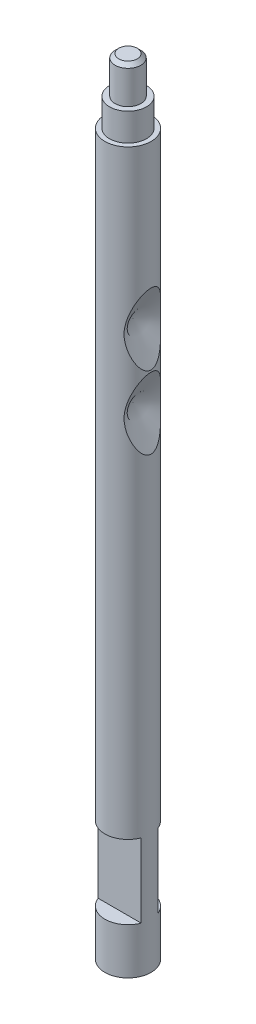
ISO-10303-21;
HEADER;
FILE_DESCRIPTION(('STEP AP214'),'2;1');
FILE_NAME('part.step','',(''),(''),'','','');
FILE_SCHEMA(('AUTOMOTIVE_DESIGN { 1 0 10303 214 1 1 1 1 }'));
ENDSEC;
DATA;
#1=APPLICATION_CONTEXT('core data for automotive mechanical design processes');
#2=APPLICATION_PROTOCOL_DEFINITION('international standard','automotive_design',2000,#1);
#3=PRODUCT_CONTEXT('',#1,'mechanical');
#4=PRODUCT('Part','Part','',(#3));
#5=PRODUCT_RELATED_PRODUCT_CATEGORY('part','',(#4));
#6=PRODUCT_DEFINITION_FORMATION('','',#4);
#7=PRODUCT_DEFINITION_CONTEXT('part definition',#1,'design');
#8=PRODUCT_DEFINITION('design','',#6,#7);
#9=PRODUCT_DEFINITION_SHAPE('','',#8);
#10=(LENGTH_UNIT() NAMED_UNIT(*) SI_UNIT(.MILLI.,.METRE.));
#11=(NAMED_UNIT(*) PLANE_ANGLE_UNIT() SI_UNIT($,.RADIAN.));
#12=(NAMED_UNIT(*) SI_UNIT($,.STERADIAN.) SOLID_ANGLE_UNIT());
#13=UNCERTAINTY_MEASURE_WITH_UNIT(LENGTH_MEASURE(1.E-05),#10,'distance_accuracy_value','');
#14=(GEOMETRIC_REPRESENTATION_CONTEXT(3) GLOBAL_UNCERTAINTY_ASSIGNED_CONTEXT((#13)) GLOBAL_UNIT_ASSIGNED_CONTEXT((#10,
#11,#12)) REPRESENTATION_CONTEXT('',''));
#15=CARTESIAN_POINT('',(0.,0.,0.));
#16=DIRECTION('',(0.,0.,1.));
#17=DIRECTION('',(1.,0.,0.));
#18=AXIS2_PLACEMENT_3D('',#15,#16,#17);
#19=CARTESIAN_POINT('',(0.,42.5,0.));
#20=DIRECTION('',(0.,-1.,0.));
#21=DIRECTION('',(0.,0.,-1.));
#22=AXIS2_PLACEMENT_3D('',#19,#20,#21);
#23=CYLINDRICAL_SURFACE('',#22,1.25);
#24=CARTESIAN_POINT('',(1.17700754416202,28.4703723541702,-0.420895760237988));
#25=CARTESIAN_POINT('',(1.16705893344819,28.4972373369061,-0.448715757895762));
#26=CARTESIAN_POINT('',(1.15661367019414,28.5256537161564,-0.474836641157097));
#27=CARTESIAN_POINT('',(1.13511480437951,28.5847272748539,-0.524153147493915));
#28=CARTESIAN_POINT('',(1.12406049890396,28.6153870574579,-0.547345284343482));
#29=CARTESIAN_POINT('',(1.09033386618107,28.7100502531933,-0.613296351795831));
#30=CARTESIAN_POINT('',(1.06717284473713,28.7765373884661,-0.652238412815612));
#31=CARTESIAN_POINT('',(1.0231512667563,28.9073281205972,-0.719097522926084));
#32=CARTESIAN_POINT('',(1.00227018597646,28.971295399089,-0.74768902668909));
#33=CARTESIAN_POINT('',(0.961505792249867,29.101769392957,-0.799432140869496));
#34=CARTESIAN_POINT('',(0.941623404522958,29.1682783661546,-0.822578777522072));
#35=CARTESIAN_POINT('',(0.903755748952343,29.3032465040863,-0.864008244839188));
#36=CARTESIAN_POINT('',(0.885768994276675,29.3717040860924,-0.882294904799336));
#37=CARTESIAN_POINT('',(0.852656109638179,29.5103295133008,-0.914334763419557));
#38=CARTESIAN_POINT('',(0.837528704912905,29.5804965805505,-0.928089984338496));
#39=CARTESIAN_POINT('',(0.812951954647161,29.7131031179047,-0.949652987862396));
#40=CARTESIAN_POINT('',(0.803020660048595,29.7753646239504,-0.958000733635408));
#41=CARTESIAN_POINT('',(0.786916058357426,29.9007289571736,-0.971274061679395));
#42=CARTESIAN_POINT('',(0.780741630865186,29.9638315277804,-0.97620066429001));
#43=CARTESIAN_POINT('',(0.772732929573768,30.0902980687057,-0.982553221289259));
#44=CARTESIAN_POINT('',(0.770885232227128,30.153660617957,-0.983990003257437));
#45=CARTESIAN_POINT('',(0.771681984158448,30.2803395707878,-0.983365171318705));
#46=CARTESIAN_POINT('',(0.77432645228205,30.3436559741727,-0.981303542735177));
#47=CARTESIAN_POINT('',(0.783818375409114,30.4695091406526,-0.973737302136117));
#48=CARTESIAN_POINT('',(0.790649597463785,30.5320479677022,-0.968245986199218));
#49=CARTESIAN_POINT('',(0.807895464307165,30.6562419585596,-0.953902209874888));
#50=CARTESIAN_POINT('',(0.818311047784375,30.7178968864777,-0.945048868962498));
#51=CARTESIAN_POINT('',(0.84204319275684,30.8403696289293,-0.923967932773515));
#52=CARTESIAN_POINT('',(0.855373353798028,30.9011820481806,-0.911724445074953));
#53=CARTESIAN_POINT('',(0.884171817353476,31.0214679985091,-0.883820765043956));
#54=CARTESIAN_POINT('',(0.899639781347253,31.0809417398352,-0.868161113433456));
#55=CARTESIAN_POINT('',(0.944795922310425,31.2445231716915,-0.819566705107155));
#56=CARTESIAN_POINT('',(0.976129928010713,31.3470905647322,-0.782710185981296));
#57=CARTESIAN_POINT('',(1.0242110071141,31.4956633802668,-0.717088162501467));
#58=CARTESIAN_POINT('',(1.04038096606971,31.5442060004323,-0.693554886867818));
#59=CARTESIAN_POINT('',(1.0727002288581,31.6391041636392,-0.642442069064977));
#60=CARTESIAN_POINT('',(1.08884953749296,31.6854617861837,-0.614866481174767));
#61=CARTESIAN_POINT('',(1.11703608581593,31.7650303127607,-0.561623174348711));
#62=CARTESIAN_POINT('',(1.12917973232564,31.7988493166575,-0.536926355109136));
#63=CARTESIAN_POINT('',(1.15283661032137,31.8640440146621,-0.484054259965215));
#64=CARTESIAN_POINT('',(1.16434873730079,31.8954154661437,-0.455873153652531));
#65=CARTESIAN_POINT('',(1.18635313874643,31.954889008242,-0.395126790579454));
#66=CARTESIAN_POINT('',(1.19683191019419,31.982948568894,-0.362514111853164));
#67=CARTESIAN_POINT('',(1.2157928214634,32.0334163864176,-0.29265151005307));
#68=CARTESIAN_POINT('',(1.22428223524554,32.05584525373,-0.255419267219288));
#69=CARTESIAN_POINT('',(1.23547132517324,32.085301596777,-0.191625508346729));
#70=CARTESIAN_POINT('',(1.23914283154282,32.0949368996846,-0.166447027404074));
#71=CARTESIAN_POINT('',(1.24499264317535,32.1102681127089,-0.114748544225874));
#72=CARTESIAN_POINT('',(1.24717268586347,32.1159686066045,-0.0882301417036052));
#73=CARTESIAN_POINT('',(1.24982005396749,32.1228891465963,-0.0343556187429182));
#74=CARTESIAN_POINT('',(1.25027725489259,32.1240827072312,-0.00699549593762304));
#75=CARTESIAN_POINT('',(1.24939460335811,32.1217765805468,0.04749983381859));
#76=CARTESIAN_POINT('',(1.24805422600373,32.1182755223937,0.0746349727456661));
#77=CARTESIAN_POINT('',(1.24388227344739,32.107358292531,0.126002808733217));
#78=CARTESIAN_POINT('',(1.24115917800984,32.1002268476282,0.150306977103077));
#79=CARTESIAN_POINT('',(1.23451986126001,32.0827965824656,0.197562675615671));
#80=CARTESIAN_POINT('',(1.23060312668679,32.0724963996407,0.220513618799267));
#81=CARTESIAN_POINT('',(1.21899833343928,32.0418807314936,0.279151981332276));
#82=CARTESIAN_POINT('',(1.21050489554076,32.0193845486027,0.313537098217497));
#83=CARTESIAN_POINT('',(1.19188147555419,31.969696365925,0.378228574862608));
#84=CARTESIAN_POINT('',(1.18174641555693,31.942489777191,0.408521726163367));
#85=CARTESIAN_POINT('',(1.15205583563401,31.8620622729859,0.48811962112393));
#86=CARTESIAN_POINT('',(1.13140787547333,31.8053325818934,0.533430839428546));
#87=CARTESIAN_POINT('',(1.08905605918043,31.6862525357468,0.615281410363181));
#88=CARTESIAN_POINT('',(1.06734894426846,31.6238842549699,0.651791330492064));
#89=CARTESIAN_POINT('',(1.02477862081227,31.4975982840995,0.71678614253526));
#90=CARTESIAN_POINT('',(1.00391057463346,31.4337934213398,0.745489812587917));
#91=CARTESIAN_POINT('',(0.963154713447086,31.3036575582663,0.797447045799542));
#92=CARTESIAN_POINT('',(0.943267827512796,31.2373242652244,0.820695518722373));
#93=CARTESIAN_POINT('',(0.905336381265718,31.1026245920698,0.862356018862954));
#94=CARTESIAN_POINT('',(0.887292379755656,31.0342576033626,0.880766581766968));
#95=CARTESIAN_POINT('',(0.85403182419341,30.8958103106608,0.91305337112989));
#96=CARTESIAN_POINT('',(0.838814004961461,30.8257307892818,0.926931628658968));
#97=CARTESIAN_POINT('',(0.814016024782304,30.6931973845285,0.948743710051295));
#98=CARTESIAN_POINT('',(0.803962680521001,30.6309209255944,0.957212266342356));
#99=CARTESIAN_POINT('',(0.787596646356649,30.5055145675941,0.970724172707706));
#100=CARTESIAN_POINT('',(0.781282844837876,30.4423849278574,0.975768540720722));
#101=CARTESIAN_POINT('',(0.77299036301433,30.3158694895934,0.982351677461078));
#102=CARTESIAN_POINT('',(0.770996851219752,30.2524853182397,0.983902440409341));
#103=CARTESIAN_POINT('',(0.771507249631646,30.125746766541,0.983502220268506));
#104=CARTESIAN_POINT('',(0.774011146950446,30.0623923861112,0.981551247213903));
#105=CARTESIAN_POINT('',(0.783242327580703,29.936434017691,0.97419966353613));
#106=CARTESIAN_POINT('',(0.789954391392081,29.8738281505507,0.968811482895699));
#107=CARTESIAN_POINT('',(0.806989191409499,29.7494905697253,0.954667447572539));
#108=CARTESIAN_POINT('',(0.817312877795704,29.6877590905338,0.945910706596336));
#109=CARTESIAN_POINT('',(0.84088850804749,29.5651254659972,0.925016380385098));
#110=CARTESIAN_POINT('',(0.854154590106005,29.5042288856502,0.912862395434873));
#111=CARTESIAN_POINT('',(0.882851962952468,29.383751536696,0.885138783001195));
#112=CARTESIAN_POINT('',(0.898282917306856,29.3241705652977,0.869569686034266));
#113=CARTESIAN_POINT('',(0.929027361646688,29.212437211295,0.836578853724176));
#114=CARTESIAN_POINT('',(0.944195294165326,29.1601423423813,0.819503072213711));
#115=CARTESIAN_POINT('',(0.975338537271264,29.0569469449319,0.782180377493527));
#116=CARTESIAN_POINT('',(0.991313691678023,29.0060461495886,0.761934076133883));
#117=CARTESIAN_POINT('',(1.02359684509875,28.9061822839057,0.717976575882371));
#118=CARTESIAN_POINT('',(1.0399028453099,28.8572109871001,0.694282723486387));
#119=CARTESIAN_POINT('',(1.07249302102962,28.7614914222474,0.642797565575012));
#120=CARTESIAN_POINT('',(1.08877720209323,28.714740987341,0.615010367168398));
#121=CARTESIAN_POINT('',(1.1170134303573,28.6350347301172,0.56166042407272));
#122=CARTESIAN_POINT('',(1.12907833549276,28.601433513415,0.537128648602745));
#123=CARTESIAN_POINT('',(1.15258684595553,28.5366409484157,0.484636492813877));
#124=CARTESIAN_POINT('',(1.16402940664587,28.5054536169568,0.456670589741793));
#125=CARTESIAN_POINT('',(1.18591174142874,28.4462981555217,0.396427762514851));
#126=CARTESIAN_POINT('',(1.19633867016194,28.418370548987,0.36410554098452));
#127=CARTESIAN_POINT('',(1.2152419560557,28.36804392706,0.294892913040601));
#128=CARTESIAN_POINT('',(1.22372508194501,28.3456257064204,0.258019068664501));
#129=CARTESIAN_POINT('',(1.23500528205099,28.3159229164981,0.19460704141875));
#130=CARTESIAN_POINT('',(1.23873986457195,28.3061203242518,0.169423791068805));
#131=CARTESIAN_POINT('',(1.24471862923363,28.2904490080629,0.11768928038964));
#132=CARTESIAN_POINT('',(1.24696457340489,28.2845756332152,0.0911396776236754));
#133=CARTESIAN_POINT('',(1.24974092646769,28.2773174981626,0.0371633189000191));
#134=CARTESIAN_POINT('',(1.25026082530171,28.2759602369002,0.00973221238245091));
#135=CARTESIAN_POINT('',(1.24949132955607,28.2779706873298,-0.0449339812043712));
#136=CARTESIAN_POINT('',(1.24820144108602,28.2813396888174,-0.0721690127258681));
#137=CARTESIAN_POINT('',(1.24411739889914,28.292026068605,-0.123662918690289));
#138=CARTESIAN_POINT('',(1.24143745904244,28.2990437451508,-0.147995320867128));
#139=CARTESIAN_POINT('',(1.23487734470092,28.3162638556021,-0.195319394268734));
#140=CARTESIAN_POINT('',(1.23099664266844,28.3264676893449,-0.218310470902912));
#141=CARTESIAN_POINT('',(1.22006922097998,28.3552909453137,-0.274040022848182));
#142=CARTESIAN_POINT('',(1.2124152145353,28.3755532976832,-0.305804368562986));
#143=CARTESIAN_POINT('',(1.1956649631858,28.4201843795094,-0.365872545797073));
#144=CARTESIAN_POINT('',(1.18656545866663,28.4445623978313,-0.394168293782631));
#145=CARTESIAN_POINT('',(1.17700754416202,28.4703723541702,-0.420895760237988));
#146=B_SPLINE_CURVE_WITH_KNOTS('',3,(#24,#25,#26,#27,#28,#29,#30,#31,#32,#33,#34,#35,#36,#37,
#38,#39,#40,#41,#42,#43,#44,#45,#46,#47,#48,#49,#50,#51,#52,#53,#54,#55,#56,#57,#58,#59,#60,#61,
#62,#63,#64,#65,#66,#67,#68,#69,#70,#71,#72,#73,#74,#75,#76,#77,#78,#79,#80,#81,#82,#83,#84,#85,
#86,#87,#88,#89,#90,#91,#92,#93,#94,#95,#96,#97,#98,#99,#100,#101,#102,#103,#104,#105,#106,#107,
#108,#109,#110,#111,#112,#113,#114,#115,#116,#117,#118,#119,#120,#121,#122,#123,#124,#125,#126,
#127,#128,#129,#130,#131,#132,#133,#134,#135,#136,#137,#138,#139,#140,#141,#142,#143,#144,#145),
.UNSPECIFIED.,.T.,.F.,(4,2,2,2,2,2,2,2,2,2,2,2,2,2,2,2,2,2,2,2,2,2,2,2,2,2,2,2,2,2,2,2,2,2,2,2,
2,2,2,2,2,2,2,2,2,2,2,2,2,2,2,2,2,2,2,2,2,2,2,2,4),(0.,0.119733935575624,0.239609078953534,
0.480210272847163,0.699298309294528,0.918585707288308,1.13769980760633,1.35671599033374,
1.54732835293315,1.73788384185972,1.92784735043226,2.11781165594633,2.30704404781057,
2.49632603445497,2.68651081952802,2.87666552332612,3.21581316174002,3.3846391698961,
3.55330111737477,3.68394744398935,3.81481542313575,3.94721403474959,4.07912071002707,
4.16044538585602,4.2416751634759,4.32338156002472,4.40511182012531,4.48124144317045,
4.55740384800416,4.68255144133255,4.80809380860544,5.03327726160536,5.25920361904884,
5.4779255990607,5.69685086377203,5.91584231553195,6.13473549516169,6.32549777462209,
6.51620331962841,6.70625313137821,6.89630239852649,7.08566825632411,7.27508397181342,
7.46543034384503,7.65574716765958,7.82684134494292,7.99790254489879,8.16813103810837,
8.33818987938421,8.46798541511413,8.59799249065811,8.72947408294129,8.86049062470549,
8.94203426781786,9.0234812184025,9.10542320655454,9.18738756099924,9.26348832570083,
9.33962257240445,9.4543918055884,9.56942361781327),.UNSPECIFIED.);
#147=CARTESIAN_POINT('',(1.17700754416202,28.4703723541702,-0.420895760237988));
#148=VERTEX_POINT('',#147);
#149=EDGE_CURVE('E51',#148,#148,#146,.T.);
#150=ORIENTED_EDGE('',*,*,#149,.F.);
#151=EDGE_LOOP('',(#150));
#152=FACE_BOUND('',#151,.T.);
#153=CARTESIAN_POINT('',(0.,6.5,0.));
#154=DIRECTION('',(0.,1.,0.));
#155=DIRECTION('',(0.,0.,1.));
#156=AXIS2_PLACEMENT_3D('',#153,#154,#155);
#157=CIRCLE('',#156,1.25);
#158=CARTESIAN_POINT('',(-1.16619037896906,6.5,0.449999999999996));
#159=VERTEX_POINT('',#158);
#160=CARTESIAN_POINT('',(1.16619037896906,6.5,0.450000000000001));
#161=VERTEX_POINT('',#160);
#162=EDGE_CURVE('E191',#159,#161,#157,.T.);
#163=ORIENTED_EDGE('',*,*,#162,.T.);
#164=DIRECTION('',(0.,-1.,0.));
#165=VECTOR('',#164,1.);
#166=CARTESIAN_POINT('',(1.16619037896906,42.5,0.449999999999996));
#167=LINE('',#166,#165);
#168=CARTESIAN_POINT('',(1.16619037896906,2.5,0.450000000000001));
#169=VERTEX_POINT('',#168);
#170=EDGE_CURVE('E116',#161,#169,#167,.T.);
#171=ORIENTED_EDGE('',*,*,#170,.T.);
#172=CARTESIAN_POINT('',(0.,2.5,0.));
#173=DIRECTION('',(0.,-1.,0.));
#174=DIRECTION('',(0.,0.,-1.));
#175=AXIS2_PLACEMENT_3D('',#172,#173,#174);
#176=CIRCLE('',#175,1.25);
#177=CARTESIAN_POINT('',(-1.16619037896906,2.5,0.450000000000001));
#178=VERTEX_POINT('',#177);
#179=EDGE_CURVE('E192',#169,#178,#176,.T.);
#180=ORIENTED_EDGE('',*,*,#179,.T.);
#181=DIRECTION('',(0.,-1.,0.));
#182=VECTOR('',#181,1.);
#183=CARTESIAN_POINT('',(-1.16619037896906,42.5,0.449999999999996));
#184=LINE('',#183,#182);
#185=EDGE_CURVE('E188',#178,#159,#184,.F.);
#186=ORIENTED_EDGE('',*,*,#185,.T.);
#187=EDGE_LOOP('',(#163,#171,#180,#186));
#188=FACE_BOUND('',#187,.T.);
#189=DIRECTION('',(0.,-1.,0.));
#190=VECTOR('',#189,1.);
#191=CARTESIAN_POINT('',(1.16619037896906,42.5,-0.449999999999996));
#192=LINE('',#191,#190);
#193=CARTESIAN_POINT('',(1.16619037896906,2.5,-0.450000000000001));
#194=VERTEX_POINT('',#193);
#195=CARTESIAN_POINT('',(1.16619037896906,6.5,-0.450000000000001));
#196=VERTEX_POINT('',#195);
#197=EDGE_CURVE('E181',#194,#196,#192,.F.);
#198=ORIENTED_EDGE('',*,*,#197,.T.);
#199=CARTESIAN_POINT('',(0.,6.5,0.));
#200=DIRECTION('',(0.,1.,0.));
#201=DIRECTION('',(0.,0.,1.));
#202=AXIS2_PLACEMENT_3D('',#199,#200,#201);
#203=CIRCLE('',#202,1.25);
#204=CARTESIAN_POINT('',(-1.16619037896906,6.5,-0.450000000000001));
#205=VERTEX_POINT('',#204);
#206=EDGE_CURVE('E65',#196,#205,#203,.T.);
#207=ORIENTED_EDGE('',*,*,#206,.T.);
#208=DIRECTION('',(0.,-1.,0.));
#209=VECTOR('',#208,1.);
#210=CARTESIAN_POINT('',(-1.16619037896906,42.5,-0.449999999999996));
#211=LINE('',#210,#209);
#212=CARTESIAN_POINT('',(-1.16619037896906,2.5,-0.450000000000001));
#213=VERTEX_POINT('',#212);
#214=EDGE_CURVE('E184',#205,#213,#211,.T.);
#215=ORIENTED_EDGE('',*,*,#214,.T.);
#216=CARTESIAN_POINT('',(0.,2.5,0.));
#217=DIRECTION('',(0.,-1.,0.));
#218=DIRECTION('',(0.,0.,-1.));
#219=AXIS2_PLACEMENT_3D('',#216,#217,#218);
#220=CIRCLE('',#219,1.25);
#221=EDGE_CURVE('E171',#213,#194,#220,.T.);
#222=ORIENTED_EDGE('',*,*,#221,.T.);
#223=EDGE_LOOP('',(#198,#207,#215,#222));
#224=FACE_BOUND('',#223,.T.);
#225=CARTESIAN_POINT('',(0.,0.,0.));
#226=DIRECTION('',(0.,1.,0.));
#227=DIRECTION('',(0.,0.,1.));
#228=AXIS2_PLACEMENT_3D('',#225,#226,#227);
#229=CIRCLE('',#228,1.25);
#230=CARTESIAN_POINT('',(0.,0.,1.25));
#231=VERTEX_POINT('',#230);
#232=EDGE_CURVE('E168',#231,#231,#229,.T.);
#233=ORIENTED_EDGE('',*,*,#232,.T.);
#234=EDGE_LOOP('',(#233));
#235=FACE_BOUND('',#234,.T.);
#236=CARTESIAN_POINT('',(0.,39.,0.));
#237=DIRECTION('',(0.,1.,0.));
#238=DIRECTION('',(0.,0.,1.));
#239=AXIS2_PLACEMENT_3D('',#236,#237,#238);
#240=CIRCLE('',#239,1.25);
#241=CARTESIAN_POINT('',(0.,39.,1.25));
#242=VERTEX_POINT('',#241);
#243=EDGE_CURVE('E174',#242,#242,#240,.T.);
#244=ORIENTED_EDGE('',*,*,#243,.F.);
#245=EDGE_LOOP('',(#244));
#246=FACE_BOUND('',#245,.T.);
#247=CARTESIAN_POINT('',(1.17700754416202,24.5203723541702,-0.420895760237988));
#248=CARTESIAN_POINT('',(1.16705893344819,24.5472373369061,-0.448715757895762));
#249=CARTESIAN_POINT('',(1.15661367019414,24.5756537161564,-0.474836641157097));
#250=CARTESIAN_POINT('',(1.13511480437951,24.6347272748539,-0.524153147493916));
#251=CARTESIAN_POINT('',(1.12406049890396,24.6653870574579,-0.547345284343483));
#252=CARTESIAN_POINT('',(1.09033386618107,24.7600502531933,-0.613296351795832));
#253=CARTESIAN_POINT('',(1.06717284473713,24.8265373884661,-0.652238412815612));
#254=CARTESIAN_POINT('',(1.0231512667563,24.9573281205972,-0.719097522926084));
#255=CARTESIAN_POINT('',(1.00227018597646,25.021295399089,-0.74768902668909));
#256=CARTESIAN_POINT('',(0.961505792249867,25.151769392957,-0.799432140869496));
#257=CARTESIAN_POINT('',(0.941623404522958,25.2182783661546,-0.822578777522072));
#258=CARTESIAN_POINT('',(0.903755748952343,25.3532465040863,-0.864008244839188));
#259=CARTESIAN_POINT('',(0.885768994276674,25.4217040860924,-0.882294904799336));
#260=CARTESIAN_POINT('',(0.852656109638178,25.5603295133008,-0.914334763419558));
#261=CARTESIAN_POINT('',(0.837528704912905,25.6304965805505,-0.928089984338496));
#262=CARTESIAN_POINT('',(0.812951954647161,25.7631031179047,-0.949652987862396));
#263=CARTESIAN_POINT('',(0.803020660048595,25.8253646239504,-0.958000733635409));
#264=CARTESIAN_POINT('',(0.786916058357426,25.9507289571736,-0.971274061679396));
#265=CARTESIAN_POINT('',(0.780741630865186,26.0138315277804,-0.97620066429001));
#266=CARTESIAN_POINT('',(0.772732929573768,26.1402980687057,-0.982553221289259));
#267=CARTESIAN_POINT('',(0.770885232227128,26.203660617957,-0.983990003257437));
#268=CARTESIAN_POINT('',(0.771681984158448,26.3303395707878,-0.983365171318705));
#269=CARTESIAN_POINT('',(0.77432645228205,26.3936559741727,-0.981303542735177));
#270=CARTESIAN_POINT('',(0.783818375409114,26.5195091406526,-0.973737302136117));
#271=CARTESIAN_POINT('',(0.790649597463785,26.5820479677022,-0.968245986199218));
#272=CARTESIAN_POINT('',(0.807895464307165,26.7062419585596,-0.953902209874888));
#273=CARTESIAN_POINT('',(0.818311047784375,26.7678968864777,-0.945048868962498));
#274=CARTESIAN_POINT('',(0.84204319275684,26.8903696289293,-0.923967932773516));
#275=CARTESIAN_POINT('',(0.855373353798028,26.9511820481806,-0.911724445074953));
#276=CARTESIAN_POINT('',(0.884171817353476,27.0714679985091,-0.883820765043956));
#277=CARTESIAN_POINT('',(0.899639781347253,27.1309417398352,-0.868161113433456));
#278=CARTESIAN_POINT('',(0.944795922310424,27.2945231716915,-0.819566705107156));
#279=CARTESIAN_POINT('',(0.976129928010712,27.3970905647322,-0.782710185981297));
#280=CARTESIAN_POINT('',(1.02421100711409,27.5456633802668,-0.717088162501469));
#281=CARTESIAN_POINT('',(1.04038096606971,27.5942060004323,-0.69355488686782));
#282=CARTESIAN_POINT('',(1.0727002288581,27.6891041636392,-0.642442069064979));
#283=CARTESIAN_POINT('',(1.08884953749296,27.7354617861837,-0.614866481174768));
#284=CARTESIAN_POINT('',(1.11703608581593,27.8150303127607,-0.561623174348711));
#285=CARTESIAN_POINT('',(1.12917973232564,27.8488493166575,-0.536926355109135));
#286=CARTESIAN_POINT('',(1.15283661032137,27.9140440146621,-0.484054259965213));
#287=CARTESIAN_POINT('',(1.16434873730079,27.9454154661437,-0.455873153652528));
#288=CARTESIAN_POINT('',(1.18635313874643,28.004889008242,-0.395126790579454));
#289=CARTESIAN_POINT('',(1.19683191019419,28.032948568894,-0.362514111853166));
#290=CARTESIAN_POINT('',(1.2157928214634,28.0834163864176,-0.292651510053073));
#291=CARTESIAN_POINT('',(1.22428223524554,28.10584525373,-0.255419267219289));
#292=CARTESIAN_POINT('',(1.23547132517324,28.135301596777,-0.191625508346727));
#293=CARTESIAN_POINT('',(1.23914283154282,28.1449368996846,-0.166447027404072));
#294=CARTESIAN_POINT('',(1.24499264317535,28.1602681127089,-0.114748544225871));
#295=CARTESIAN_POINT('',(1.24717268586347,28.1659686066045,-0.0882301417036009));
#296=CARTESIAN_POINT('',(1.24982005396749,28.1728891465963,-0.0343556187429132));
#297=CARTESIAN_POINT('',(1.25027725489259,28.1740827072312,-0.00699549593761816));
#298=CARTESIAN_POINT('',(1.24939460335811,28.1717765805468,0.0474998338185946));
#299=CARTESIAN_POINT('',(1.24805422600373,28.1682755223937,0.0746349727456704));
#300=CARTESIAN_POINT('',(1.24388227344739,28.157358292531,0.12600280873322));
#301=CARTESIAN_POINT('',(1.24115917800984,28.1502268476282,0.150306977103079));
#302=CARTESIAN_POINT('',(1.23451986126001,28.1327965824656,0.197562675615674));
#303=CARTESIAN_POINT('',(1.23060312668679,28.1224963996407,0.220513618799271));
#304=CARTESIAN_POINT('',(1.21899833343928,28.0918807314936,0.279151981332281));
#305=CARTESIAN_POINT('',(1.21050489554076,28.0693845486027,0.313537098217503));
#306=CARTESIAN_POINT('',(1.19188147555418,28.019696365925,0.378228574862614));
#307=CARTESIAN_POINT('',(1.18174641555693,27.992489777191,0.408521726163374));
#308=CARTESIAN_POINT('',(1.15205583563401,27.9120622729859,0.488119621123937));
#309=CARTESIAN_POINT('',(1.13140787547333,27.8553325818933,0.533430839428556));
#310=CARTESIAN_POINT('',(1.08905605918042,27.7362525357468,0.615281410363192));
#311=CARTESIAN_POINT('',(1.06734894426845,27.6738842549699,0.651791330492074));
#312=CARTESIAN_POINT('',(1.02477862081226,27.5475982840995,0.71678614253527));
#313=CARTESIAN_POINT('',(1.00391057463345,27.4837934213397,0.745489812587929));
#314=CARTESIAN_POINT('',(0.963154713447077,27.3536575582662,0.797447045799554));
#315=CARTESIAN_POINT('',(0.943267827512788,27.2873242652244,0.820695518722384));
#316=CARTESIAN_POINT('',(0.905336381265709,27.1526245920698,0.862356018862963));
#317=CARTESIAN_POINT('',(0.887292379755647,27.0842576033625,0.880766581766976));
#318=CARTESIAN_POINT('',(0.854031824193402,26.9458103106608,0.913053371129897));
#319=CARTESIAN_POINT('',(0.838814004961454,26.8757307892817,0.926931628658975));
#320=CARTESIAN_POINT('',(0.814016024782298,26.7431973845285,0.9487437100513));
#321=CARTESIAN_POINT('',(0.803962680520995,26.6809209255944,0.957212266342361));
#322=CARTESIAN_POINT('',(0.787596646356645,26.5555145675941,0.97072417270771));
#323=CARTESIAN_POINT('',(0.781282844837873,26.4923849278573,0.975768540720725));
#324=CARTESIAN_POINT('',(0.772990363014328,26.3658694895934,0.98235167746108));
#325=CARTESIAN_POINT('',(0.770996851219751,26.3024853182396,0.983902440409342));
#326=CARTESIAN_POINT('',(0.771507249631647,26.175746766541,0.983502220268506));
#327=CARTESIAN_POINT('',(0.774011146950448,26.1123923861111,0.981551247213901));
#328=CARTESIAN_POINT('',(0.783242327580706,25.986434017691,0.974199663536127));
#329=CARTESIAN_POINT('',(0.789954391392085,25.9238281505507,0.968811482895696));
#330=CARTESIAN_POINT('',(0.806989191409504,25.7994905697252,0.954667447572535));
#331=CARTESIAN_POINT('',(0.81731287779571,25.7377590905338,0.945910706596332));
#332=CARTESIAN_POINT('',(0.840888508047496,25.6151254659972,0.925016380385093));
#333=CARTESIAN_POINT('',(0.854154590106011,25.5542288856502,0.912862395434867));
#334=CARTESIAN_POINT('',(0.882851962952475,25.433751536696,0.885138783001187));
#335=CARTESIAN_POINT('',(0.898282917306864,25.3741705652977,0.869569686034259));
#336=CARTESIAN_POINT('',(0.929027361646697,25.2624372112949,0.836578853724166));
#337=CARTESIAN_POINT('',(0.944195294165336,25.2101423423813,0.819503072213701));
#338=CARTESIAN_POINT('',(0.975338537271273,25.1069469449319,0.782180377493516));
#339=CARTESIAN_POINT('',(0.991313691678031,25.0560461495886,0.761934076133872));
#340=CARTESIAN_POINT('',(1.02359684509875,24.9561822839057,0.717976575882363));
#341=CARTESIAN_POINT('',(1.03990284530991,24.9072109871001,0.694282723486379));
#342=CARTESIAN_POINT('',(1.07249302102962,24.8114914222474,0.642797565575007));
#343=CARTESIAN_POINT('',(1.08877720209323,24.764740987341,0.615010367168396));
#344=CARTESIAN_POINT('',(1.1170134303573,24.6850347301172,0.561660424072719));
#345=CARTESIAN_POINT('',(1.12907833549276,24.651433513415,0.537128648602744));
#346=CARTESIAN_POINT('',(1.15258684595553,24.5866409484157,0.484636492813874));
#347=CARTESIAN_POINT('',(1.16402940664587,24.5554536169568,0.456670589741788));
#348=CARTESIAN_POINT('',(1.18591174142874,24.4962981555217,0.396427762514842));
#349=CARTESIAN_POINT('',(1.19633867016194,24.468370548987,0.364105540984508));
#350=CARTESIAN_POINT('',(1.21524195605571,24.41804392706,0.294892913040585));
#351=CARTESIAN_POINT('',(1.22372508194502,24.3956257064204,0.258019068664483));
#352=CARTESIAN_POINT('',(1.235005282051,24.3659229164981,0.194607041418733));
#353=CARTESIAN_POINT('',(1.23873986457195,24.3561203242518,0.169423791068789));
#354=CARTESIAN_POINT('',(1.24471862923363,24.3404490080629,0.117689280389625));
#355=CARTESIAN_POINT('',(1.24696457340489,24.3345756332152,0.0911396776236609));
#356=CARTESIAN_POINT('',(1.24974092646769,24.3273174981626,0.0371633189000054));
#357=CARTESIAN_POINT('',(1.25026082530171,24.3259602369002,0.00973221238243763));
#358=CARTESIAN_POINT('',(1.24949132955607,24.3279706873298,-0.0449339812043835));
#359=CARTESIAN_POINT('',(1.24820144108601,24.3313396888174,-0.0721690127258797));
#360=CARTESIAN_POINT('',(1.24411739889914,24.342026068605,-0.1236629186903));
#361=CARTESIAN_POINT('',(1.24143745904244,24.3490437451508,-0.147995320867139));
#362=CARTESIAN_POINT('',(1.23487734470092,24.3662638556021,-0.195319394268744));
#363=CARTESIAN_POINT('',(1.23099664266844,24.3764676893449,-0.218310470902922));
#364=CARTESIAN_POINT('',(1.22006922097997,24.4052909453137,-0.27404002284819));
#365=CARTESIAN_POINT('',(1.2124152145353,24.4255532976832,-0.305804368562994));
#366=CARTESIAN_POINT('',(1.19566496318579,24.4701843795094,-0.365872545797077));
#367=CARTESIAN_POINT('',(1.18656545866663,24.4945623978313,-0.394168293782633));
#368=CARTESIAN_POINT('',(1.17700754416202,24.5203723541702,-0.420895760237988));
#369=B_SPLINE_CURVE_WITH_KNOTS('',3,(#247,#248,#249,#250,#251,#252,#253,#254,#255,#256,#257,
#258,#259,#260,#261,#262,#263,#264,#265,#266,#267,#268,#269,#270,#271,#272,#273,#274,#275,#276,
#277,#278,#279,#280,#281,#282,#283,#284,#285,#286,#287,#288,#289,#290,#291,#292,#293,#294,#295,
#296,#297,#298,#299,#300,#301,#302,#303,#304,#305,#306,#307,#308,#309,#310,#311,#312,#313,#314,
#315,#316,#317,#318,#319,#320,#321,#322,#323,#324,#325,#326,#327,#328,#329,#330,#331,#332,#333,
#334,#335,#336,#337,#338,#339,#340,#341,#342,#343,#344,#345,#346,#347,#348,#349,#350,#351,#352,
#353,#354,#355,#356,#357,#358,#359,#360,#361,#362,#363,#364,#365,#366,#367,#368),.UNSPECIFIED.,
.T.,.F.,(4,2,2,2,2,2,2,2,2,2,2,2,2,2,2,2,2,2,2,2,2,2,2,2,2,2,2,2,2,2,2,2,2,2,2,2,2,2,2,2,2,2,2,
2,2,2,2,2,2,2,2,2,2,2,2,2,2,2,2,2,4),(0.,0.119733935575624,0.239609078953538,0.480210272847163,
0.699298309294528,0.918585707288308,1.13769980760633,1.35671599033374,1.54732835293315,
1.73788384185972,1.92784735043226,2.11781165594633,2.30704404781057,2.49632603445497,
2.68651081952801,2.87666552332611,3.21581316174002,3.38463916989609,3.55330111737476,
3.68394744398935,3.81481542313575,3.94721403474958,4.07912071002707,4.16044538585602,
4.2416751634759,4.32338156002472,4.40511182012532,4.48124144317045,4.55740384800417,
4.68255144133255,4.80809380860545,5.03327726160537,5.25920361904886,5.47792559906073,
5.69685086377206,5.91584231553199,6.13473549516173,6.32549777462213,6.51620331962845,
6.70625313137825,6.89630239852652,7.08566825632414,7.27508397181345,7.46543034384506,
7.65574716765962,7.82684134494296,7.99790254489881,8.16813103810838,8.3381898793842,
8.46798541511413,8.59799249065812,8.72947408294131,8.86049062470551,8.94203426781788,
9.02348121840251,9.10542320655455,9.18738756099925,9.26348832570083,9.33962257240445,
9.45439180558841,9.56942361781327),.UNSPECIFIED.);
#370=CARTESIAN_POINT('',(1.17700754416202,24.5203723541702,-0.420895760237988));
#371=VERTEX_POINT('',#370);
#372=EDGE_CURVE('E12',#371,#371,#369,.T.);
#373=ORIENTED_EDGE('',*,*,#372,.F.);
#374=EDGE_LOOP('',(#373));
#375=FACE_BOUND('',#374,.T.);
#376=ADVANCED_FACE('F40',(#152,#188,#224,#235,#246,#375),#23,.T.);
#377=CARTESIAN_POINT('',(0.,39.,0.));
#378=DIRECTION('',(0.,1.,0.));
#379=DIRECTION('',(0.,0.,1.));
#380=AXIS2_PLACEMENT_3D('',#377,#378,#379);
#381=CYLINDRICAL_SURFACE('',#380,1.);
#382=CARTESIAN_POINT('',(0.,39.,0.));
#383=DIRECTION('',(0.,1.,0.));
#384=DIRECTION('',(0.,0.,1.));
#385=AXIS2_PLACEMENT_3D('',#382,#383,#384);
#386=CIRCLE('',#385,1.);
#387=CARTESIAN_POINT('',(0.,39.,1.));
#388=VERTEX_POINT('',#387);
#389=EDGE_CURVE('E210',#388,#388,#386,.T.);
#390=ORIENTED_EDGE('',*,*,#389,.T.);
#391=EDGE_LOOP('',(#390));
#392=FACE_BOUND('',#391,.T.);
#393=CARTESIAN_POINT('',(0.,40.5,0.));
#394=DIRECTION('',(0.,1.,0.));
#395=DIRECTION('',(0.,0.,1.));
#396=AXIS2_PLACEMENT_3D('',#393,#394,#395);
#397=CIRCLE('',#396,1.);
#398=CARTESIAN_POINT('',(0.,40.5,1.));
#399=VERTEX_POINT('',#398);
#400=EDGE_CURVE('E177',#399,#399,#397,.F.);
#401=ORIENTED_EDGE('',*,*,#400,.T.);
#402=EDGE_LOOP('',(#401));
#403=FACE_BOUND('',#402,.T.);
#404=ADVANCED_FACE('F97',(#392,#403),#381,.T.);
#405=CARTESIAN_POINT('',(0.,0.,0.));
#406=DIRECTION('',(0.,1.,0.));
#407=DIRECTION('',(0.,0.,1.));
#408=AXIS2_PLACEMENT_3D('',#405,#406,#407);
#409=PLANE('',#408);
#410=ORIENTED_EDGE('',*,*,#232,.F.);
#411=EDGE_LOOP('',(#410));
#412=FACE_BOUND('',#411,.T.);
#413=ADVANCED_FACE('F102',(#412),#409,.F.);
#414=CARTESIAN_POINT('',(0.,39.,0.));
#415=DIRECTION('',(0.,1.,0.));
#416=DIRECTION('',(0.,0.,1.));
#417=AXIS2_PLACEMENT_3D('',#414,#415,#416);
#418=PLANE('',#417);
#419=ORIENTED_EDGE('',*,*,#389,.F.);
#420=EDGE_LOOP('',(#419));
#421=FACE_BOUND('',#420,.T.);
#422=ORIENTED_EDGE('',*,*,#243,.T.);
#423=EDGE_LOOP('',(#422));
#424=FACE_BOUND('',#423,.T.);
#425=ADVANCED_FACE('F152',(#421,#424),#418,.T.);
#426=CARTESIAN_POINT('',(0.,40.5,0.));
#427=DIRECTION('',(0.,1.,0.));
#428=DIRECTION('',(0.,0.,1.));
#429=AXIS2_PLACEMENT_3D('',#426,#427,#428);
#430=PLANE('',#429);
#431=ORIENTED_EDGE('',*,*,#400,.F.);
#432=EDGE_LOOP('',(#431));
#433=FACE_BOUND('',#432,.T.);
#434=CARTESIAN_POINT('',(0.,40.5,0.));
#435=DIRECTION('',(0.,1.,0.));
#436=DIRECTION('',(0.,0.,1.));
#437=AXIS2_PLACEMENT_3D('',#434,#435,#436);
#438=CIRCLE('',#437,0.7);
#439=CARTESIAN_POINT('',(0.,40.5,0.7));
#440=VERTEX_POINT('',#439);
#441=EDGE_CURVE('E206',#440,#440,#438,.T.);
#442=ORIENTED_EDGE('',*,*,#441,.F.);
#443=EDGE_LOOP('',(#442));
#444=FACE_BOUND('',#443,.T.);
#445=ADVANCED_FACE('F149',(#433,#444),#430,.T.);
#446=CARTESIAN_POINT('',(0.,40.5,0.));
#447=DIRECTION('',(0.,1.,0.));
#448=DIRECTION('',(0.,0.,1.));
#449=AXIS2_PLACEMENT_3D('',#446,#447,#448);
#450=CYLINDRICAL_SURFACE('',#449,0.7);
#451=CARTESIAN_POINT('',(0.,42.3,0.));
#452=DIRECTION('',(0.,1.,0.));
#453=DIRECTION('',(0.,0.,1.));
#454=AXIS2_PLACEMENT_3D('',#451,#452,#453);
#455=CIRCLE('',#454,0.7);
#456=CARTESIAN_POINT('',(0.,42.3,0.7));
#457=VERTEX_POINT('',#456);
#458=EDGE_CURVE('E167',#457,#457,#455,.F.);
#459=ORIENTED_EDGE('',*,*,#458,.T.);
#460=EDGE_LOOP('',(#459));
#461=FACE_BOUND('',#460,.T.);
#462=ORIENTED_EDGE('',*,*,#441,.T.);
#463=EDGE_LOOP('',(#462));
#464=FACE_BOUND('',#463,.T.);
#465=ADVANCED_FACE('F145',(#461,#464),#450,.T.);
#466=CARTESIAN_POINT('',(0.,42.5,0.));
#467=DIRECTION('',(0.,1.,0.));
#468=DIRECTION('',(0.,0.,1.));
#469=AXIS2_PLACEMENT_3D('',#466,#467,#468);
#470=PLANE('',#469);
#471=CARTESIAN_POINT('',(0.,42.5,0.));
#472=DIRECTION('',(0.,1.,0.));
#473=DIRECTION('',(0.,0.,1.));
#474=AXIS2_PLACEMENT_3D('',#471,#472,#473);
#475=CIRCLE('',#474,0.499999999999997);
#476=CARTESIAN_POINT('',(0.,42.5,0.499999999999997));
#477=VERTEX_POINT('',#476);
#478=EDGE_CURVE('E165',#477,#477,#475,.T.);
#479=ORIENTED_EDGE('',*,*,#478,.T.);
#480=EDGE_LOOP('',(#479));
#481=FACE_BOUND('',#480,.T.);
#482=ADVANCED_FACE('F148',(#481),#470,.T.);
#483=CARTESIAN_POINT('',(0.,42.5,0.));
#484=DIRECTION('',(0.,-1.,0.));
#485=DIRECTION('',(0.,0.,-1.));
#486=AXIS2_PLACEMENT_3D('',#483,#484,#485);
#487=CONICAL_SURFACE('',#486,0.499999999999997,0.785398163397442);
#488=ORIENTED_EDGE('',*,*,#458,.F.);
#489=EDGE_LOOP('',(#488));
#490=FACE_BOUND('',#489,.T.);
#491=ORIENTED_EDGE('',*,*,#478,.F.);
#492=EDGE_LOOP('',(#491));
#493=FACE_BOUND('',#492,.T.);
#494=ADVANCED_FACE('F42',(#490,#493),#487,.T.);
#495=CARTESIAN_POINT('',(-1.25,6.5,-0.450000000000001));
#496=DIRECTION('',(0.,0.,1.));
#497=DIRECTION('',(0.,-1.,0.));
#498=AXIS2_PLACEMENT_3D('',#495,#496,#497);
#499=PLANE('',#498);
#500=DIRECTION('',(1.,0.,0.));
#501=VECTOR('',#500,1.);
#502=CARTESIAN_POINT('',(-1.25,6.5,-0.450000000000001));
#503=LINE('',#502,#501);
#504=EDGE_CURVE('E202',#205,#196,#503,.T.);
#505=ORIENTED_EDGE('',*,*,#504,.T.);
#506=ORIENTED_EDGE('',*,*,#197,.F.);
#507=DIRECTION('',(1.,0.,0.));
#508=VECTOR('',#507,1.);
#509=CARTESIAN_POINT('',(-1.25,2.5,-0.450000000000001));
#510=LINE('',#509,#508);
#511=EDGE_CURVE('E199',#213,#194,#510,.T.);
#512=ORIENTED_EDGE('',*,*,#511,.F.);
#513=ORIENTED_EDGE('',*,*,#214,.F.);
#514=EDGE_LOOP('',(#505,#506,#512,#513));
#515=FACE_BOUND('',#514,.T.);
#516=ADVANCED_FACE('F138',(#515),#499,.F.);
#517=CARTESIAN_POINT('',(-1.25,6.5,-0.450000000000001));
#518=DIRECTION('',(0.,1.,0.));
#519=DIRECTION('',(0.,0.,1.));
#520=AXIS2_PLACEMENT_3D('',#517,#518,#519);
#521=PLANE('',#520);
#522=ORIENTED_EDGE('',*,*,#504,.F.);
#523=ORIENTED_EDGE('',*,*,#206,.F.);
#524=EDGE_LOOP('',(#522,#523));
#525=FACE_BOUND('',#524,.T.);
#526=ADVANCED_FACE('F135',(#525),#521,.F.);
#527=CARTESIAN_POINT('',(-1.25,2.5,-0.450000000000001));
#528=DIRECTION('',(0.,-1.,0.));
#529=DIRECTION('',(0.,0.,-1.));
#530=AXIS2_PLACEMENT_3D('',#527,#528,#529);
#531=PLANE('',#530);
#532=ORIENTED_EDGE('',*,*,#221,.F.);
#533=ORIENTED_EDGE('',*,*,#511,.T.);
#534=EDGE_LOOP('',(#532,#533));
#535=FACE_BOUND('',#534,.T.);
#536=ADVANCED_FACE('F133',(#535),#531,.F.);
#537=CARTESIAN_POINT('',(-1.25,2.5,0.450000000000001));
#538=DIRECTION('',(0.,-1.,0.));
#539=DIRECTION('',(0.,0.,-1.));
#540=AXIS2_PLACEMENT_3D('',#537,#538,#539);
#541=PLANE('',#540);
#542=DIRECTION('',(1.,0.,0.));
#543=VECTOR('',#542,1.);
#544=CARTESIAN_POINT('',(-1.25,2.5,0.450000000000001));
#545=LINE('',#544,#543);
#546=EDGE_CURVE('E198',#178,#169,#545,.T.);
#547=ORIENTED_EDGE('',*,*,#546,.F.);
#548=ORIENTED_EDGE('',*,*,#179,.F.);
#549=EDGE_LOOP('',(#547,#548));
#550=FACE_BOUND('',#549,.T.);
#551=ADVANCED_FACE('F127',(#550),#541,.F.);
#552=CARTESIAN_POINT('',(-1.25,6.5,0.450000000000001));
#553=DIRECTION('',(0.,1.,0.));
#554=DIRECTION('',(0.,0.,1.));
#555=AXIS2_PLACEMENT_3D('',#552,#553,#554);
#556=PLANE('',#555);
#557=ORIENTED_EDGE('',*,*,#162,.F.);
#558=DIRECTION('',(1.,0.,0.));
#559=VECTOR('',#558,1.);
#560=CARTESIAN_POINT('',(-1.25,6.5,0.450000000000001));
#561=LINE('',#560,#559);
#562=EDGE_CURVE('E58',#159,#161,#561,.T.);
#563=ORIENTED_EDGE('',*,*,#562,.T.);
#564=EDGE_LOOP('',(#557,#563));
#565=FACE_BOUND('',#564,.T.);
#566=ADVANCED_FACE('F124',(#565),#556,.F.);
#567=CARTESIAN_POINT('',(-1.25,6.5,0.450000000000001));
#568=DIRECTION('',(0.,0.,-1.));
#569=DIRECTION('',(0.,1.,0.));
#570=AXIS2_PLACEMENT_3D('',#567,#568,#569);
#571=PLANE('',#570);
#572=ORIENTED_EDGE('',*,*,#562,.F.);
#573=ORIENTED_EDGE('',*,*,#185,.F.);
#574=ORIENTED_EDGE('',*,*,#546,.T.);
#575=ORIENTED_EDGE('',*,*,#170,.F.);
#576=EDGE_LOOP('',(#572,#573,#574,#575));
#577=FACE_BOUND('',#576,.T.);
#578=ADVANCED_FACE('F121',(#577),#571,.F.);
#579=CARTESIAN_POINT('',(1.25,30.2,0.));
#580=DIRECTION('',(1.,0.,0.));
#581=DIRECTION('',(0.,0.,-1.));
#582=AXIS2_PLACEMENT_3D('',#579,#580,#581);
#583=CONICAL_SURFACE('',#582,1.92335829539504,1.09955742875643);
#584=CARTESIAN_POINT('',(0.27,30.2,0.));
#585=VERTEX_POINT('',#584);
#586=VERTEX_LOOP('',#585);
#587=FACE_BOUND('',#586,.T.);
#588=ORIENTED_EDGE('',*,*,#149,.T.);
#589=EDGE_LOOP('',(#588));
#590=FACE_BOUND('',#589,.T.);
#591=ADVANCED_FACE('F93',(#587,#590),#583,.F.);
#592=CARTESIAN_POINT('',(1.25,26.25,0.));
#593=DIRECTION('',(1.,0.,0.));
#594=DIRECTION('',(0.,0.,-1.));
#595=AXIS2_PLACEMENT_3D('',#592,#593,#594);
#596=CONICAL_SURFACE('',#595,1.92335829539504,1.09955742875643);
#597=CARTESIAN_POINT('',(0.27,26.25,0.));
#598=VERTEX_POINT('',#597);
#599=VERTEX_LOOP('',#598);
#600=FACE_BOUND('',#599,.T.);
#601=ORIENTED_EDGE('',*,*,#372,.T.);
#602=EDGE_LOOP('',(#601));
#603=FACE_BOUND('',#602,.T.);
#604=ADVANCED_FACE('F90',(#600,#603),#596,.F.);
#605=CLOSED_SHELL('',(#376,#404,#413,#425,#445,#465,#482,#494,#516,#526,#536,#551,#566,#578,
#591,#604));
#606=MANIFOLD_SOLID_BREP('B2',#605);
#607=ADVANCED_BREP_SHAPE_REPRESENTATION('',(#18,#606),#14);
#608=SHAPE_DEFINITION_REPRESENTATION(#9,#607);
ENDSEC;
END-ISO-10303-21;
